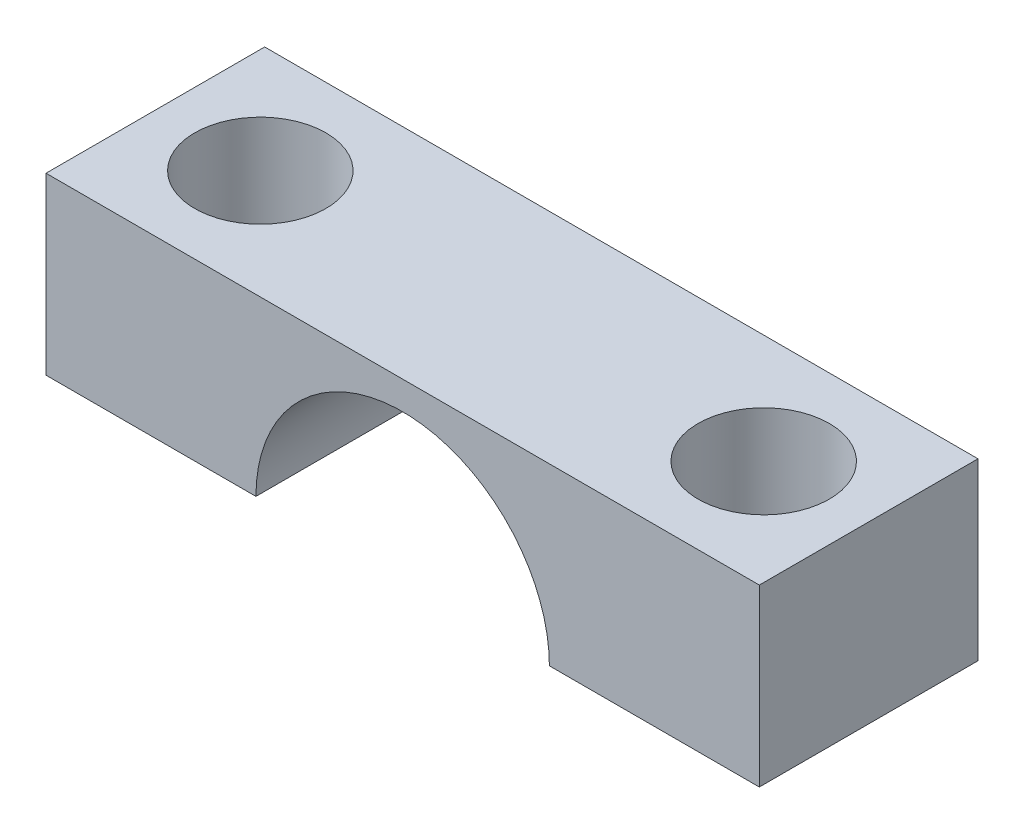
ISO-10303-21;
HEADER;
FILE_DESCRIPTION(('STEP AP214'),'2;1');
FILE_NAME('part.step','',(''),(''),'','','');
FILE_SCHEMA(('AUTOMOTIVE_DESIGN { 1 0 10303 214 1 1 1 1 }'));
ENDSEC;
DATA;
#1=APPLICATION_CONTEXT('core data for automotive mechanical design processes');
#2=APPLICATION_PROTOCOL_DEFINITION('international standard','automotive_design',2000,#1);
#3=PRODUCT_CONTEXT('',#1,'mechanical');
#4=PRODUCT('Part','Part','',(#3));
#5=PRODUCT_RELATED_PRODUCT_CATEGORY('part','',(#4));
#6=PRODUCT_DEFINITION_FORMATION('','',#4);
#7=PRODUCT_DEFINITION_CONTEXT('part definition',#1,'design');
#8=PRODUCT_DEFINITION('design','',#6,#7);
#9=PRODUCT_DEFINITION_SHAPE('','',#8);
#10=(LENGTH_UNIT() NAMED_UNIT(*) SI_UNIT(.MILLI.,.METRE.));
#11=(NAMED_UNIT(*) PLANE_ANGLE_UNIT() SI_UNIT($,.RADIAN.));
#12=(NAMED_UNIT(*) SI_UNIT($,.STERADIAN.) SOLID_ANGLE_UNIT());
#13=UNCERTAINTY_MEASURE_WITH_UNIT(LENGTH_MEASURE(1.E-05),#10,'distance_accuracy_value','');
#14=(GEOMETRIC_REPRESENTATION_CONTEXT(3) GLOBAL_UNCERTAINTY_ASSIGNED_CONTEXT((#13)) GLOBAL_UNIT_ASSIGNED_CONTEXT((#10,
#11,#12)) REPRESENTATION_CONTEXT('',''));
#15=CARTESIAN_POINT('',(0.,0.,0.));
#16=DIRECTION('',(0.,0.,1.));
#17=DIRECTION('',(1.,0.,0.));
#18=AXIS2_PLACEMENT_3D('',#15,#16,#17);
#19=CARTESIAN_POINT('',(-8.155,-2.,-5.));
#20=DIRECTION('',(0.,-1.,0.));
#21=DIRECTION('',(0.,0.,-1.));
#22=AXIS2_PLACEMENT_3D('',#19,#20,#21);
#23=PLANE('',#22);
#24=CARTESIAN_POINT('',(5.755,-2.,-2.5));
#25=DIRECTION('',(0.,-1.,0.));
#26=DIRECTION('',(0.,0.,-1.));
#27=AXIS2_PLACEMENT_3D('',#24,#25,#26);
#28=CIRCLE('',#27,1.5);
#29=CARTESIAN_POINT('',(5.755,-2.,-4.));
#30=VERTEX_POINT('',#29);
#31=EDGE_CURVE('E136',#30,#30,#28,.F.);
#32=ORIENTED_EDGE('',*,*,#31,.T.);
#33=EDGE_LOOP('',(#32));
#34=FACE_BOUND('',#33,.T.);
#35=DIRECTION('',(0.,0.,1.));
#36=VECTOR('',#35,1.);
#37=CARTESIAN_POINT('',(3.355,-2.,-5.));
#38=LINE('',#37,#36);
#39=CARTESIAN_POINT('',(3.355,-2.,-5.));
#40=VERTEX_POINT('',#39);
#41=CARTESIAN_POINT('',(3.355,-2.,0.));
#42=VERTEX_POINT('',#41);
#43=EDGE_CURVE('E53',#40,#42,#38,.T.);
#44=ORIENTED_EDGE('',*,*,#43,.F.);
#45=DIRECTION('',(1.,0.,0.));
#46=VECTOR('',#45,1.);
#47=CARTESIAN_POINT('',(-8.155,-2.,-5.));
#48=LINE('',#47,#46);
#49=CARTESIAN_POINT('',(8.155,-2.,-5.));
#50=VERTEX_POINT('',#49);
#51=EDGE_CURVE('E85',#40,#50,#48,.T.);
#52=ORIENTED_EDGE('',*,*,#51,.T.);
#53=DIRECTION('',(0.,0.,1.));
#54=VECTOR('',#53,1.);
#55=CARTESIAN_POINT('',(8.155,-2.,-5.));
#56=LINE('',#55,#54);
#57=CARTESIAN_POINT('',(8.155,-2.,0.));
#58=VERTEX_POINT('',#57);
#59=EDGE_CURVE('E119',#50,#58,#56,.T.);
#60=ORIENTED_EDGE('',*,*,#59,.T.);
#61=DIRECTION('',(1.,0.,0.));
#62=VECTOR('',#61,1.);
#63=CARTESIAN_POINT('',(-8.155,-2.,0.));
#64=LINE('',#63,#62);
#65=EDGE_CURVE('E123',#42,#58,#64,.T.);
#66=ORIENTED_EDGE('',*,*,#65,.F.);
#67=EDGE_LOOP('',(#44,#52,#60,#66));
#68=FACE_BOUND('',#67,.T.);
#69=ADVANCED_FACE('F36',(#34,#68),#23,.T.);
#70=CARTESIAN_POINT('',(-5.755,-2.,-2.5));
#71=DIRECTION('',(0.,-1.,0.));
#72=DIRECTION('',(0.,0.,-1.));
#73=AXIS2_PLACEMENT_3D('',#70,#71,#72);
#74=CIRCLE('',#73,1.5);
#75=CARTESIAN_POINT('',(-5.755,-2.,-4.));
#76=VERTEX_POINT('',#75);
#77=EDGE_CURVE('E144',#76,#76,#74,.F.);
#78=ORIENTED_EDGE('',*,*,#77,.T.);
#79=EDGE_LOOP('',(#78));
#80=FACE_BOUND('',#79,.T.);
#81=DIRECTION('',(0.,0.,1.));
#82=VECTOR('',#81,1.);
#83=CARTESIAN_POINT('',(-3.355,-2.,-5.));
#84=LINE('',#83,#82);
#85=CARTESIAN_POINT('',(-3.355,-2.,-5.));
#86=VERTEX_POINT('',#85);
#87=CARTESIAN_POINT('',(-3.355,-2.,0.));
#88=VERTEX_POINT('',#87);
#89=EDGE_CURVE('E95',#86,#88,#84,.T.);
#90=ORIENTED_EDGE('',*,*,#89,.T.);
#91=CARTESIAN_POINT('',(-8.155,-2.,0.));
#92=VERTEX_POINT('',#91);
#93=EDGE_CURVE('E120',#92,#88,#64,.T.);
#94=ORIENTED_EDGE('',*,*,#93,.F.);
#95=DIRECTION('',(0.,0.,1.));
#96=VECTOR('',#95,1.);
#97=CARTESIAN_POINT('',(-8.155,-2.,-5.));
#98=LINE('',#97,#96);
#99=CARTESIAN_POINT('',(-8.155,-2.,-5.));
#100=VERTEX_POINT('',#99);
#101=EDGE_CURVE('E11',#100,#92,#98,.T.);
#102=ORIENTED_EDGE('',*,*,#101,.F.);
#103=EDGE_CURVE('E105',#100,#86,#48,.T.);
#104=ORIENTED_EDGE('',*,*,#103,.T.);
#105=EDGE_LOOP('',(#90,#94,#102,#104));
#106=FACE_BOUND('',#105,.T.);
#107=ADVANCED_FACE('F38',(#80,#106),#23,.T.);
#108=CARTESIAN_POINT('',(-8.155,-2.,-5.));
#109=DIRECTION('',(1.,0.,0.));
#110=DIRECTION('',(0.,0.,-1.));
#111=AXIS2_PLACEMENT_3D('',#108,#109,#110);
#112=PLANE('',#111);
#113=DIRECTION('',(0.,1.,0.));
#114=VECTOR('',#113,1.);
#115=CARTESIAN_POINT('',(-8.155,-2.,0.));
#116=LINE('',#115,#114);
#117=CARTESIAN_POINT('',(-8.155,2.,0.));
#118=VERTEX_POINT('',#117);
#119=EDGE_CURVE('E113',#92,#118,#116,.T.);
#120=ORIENTED_EDGE('',*,*,#119,.T.);
#121=DIRECTION('',(0.,0.,1.));
#122=VECTOR('',#121,1.);
#123=CARTESIAN_POINT('',(-8.155,2.,-5.));
#124=LINE('',#123,#122);
#125=CARTESIAN_POINT('',(-8.155,2.,-5.));
#126=VERTEX_POINT('',#125);
#127=EDGE_CURVE('E45',#126,#118,#124,.T.);
#128=ORIENTED_EDGE('',*,*,#127,.F.);
#129=DIRECTION('',(0.,1.,0.));
#130=VECTOR('',#129,1.);
#131=CARTESIAN_POINT('',(-8.155,-2.,-5.));
#132=LINE('',#131,#130);
#133=EDGE_CURVE('E117',#100,#126,#132,.T.);
#134=ORIENTED_EDGE('',*,*,#133,.F.);
#135=ORIENTED_EDGE('',*,*,#101,.T.);
#136=EDGE_LOOP('',(#120,#128,#134,#135));
#137=FACE_BOUND('',#136,.T.);
#138=ADVANCED_FACE('F160',(#137),#112,.F.);
#139=CARTESIAN_POINT('',(-8.155,2.,-5.));
#140=DIRECTION('',(0.,-1.,0.));
#141=DIRECTION('',(0.,0.,-1.));
#142=AXIS2_PLACEMENT_3D('',#139,#140,#141);
#143=PLANE('',#142);
#144=CARTESIAN_POINT('',(-5.755,2.,-2.5));
#145=DIRECTION('',(0.,-1.,0.));
#146=DIRECTION('',(0.,0.,-1.));
#147=AXIS2_PLACEMENT_3D('',#144,#145,#146);
#148=CIRCLE('',#147,1.5);
#149=CARTESIAN_POINT('',(-5.755,2.,-4.));
#150=VERTEX_POINT('',#149);
#151=EDGE_CURVE('E40',#150,#150,#148,.F.);
#152=ORIENTED_EDGE('',*,*,#151,.F.);
#153=EDGE_LOOP('',(#152));
#154=FACE_BOUND('',#153,.T.);
#155=CARTESIAN_POINT('',(5.755,2.,-2.5));
#156=DIRECTION('',(0.,-1.,0.));
#157=DIRECTION('',(0.,0.,-1.));
#158=AXIS2_PLACEMENT_3D('',#155,#156,#157);
#159=CIRCLE('',#158,1.5);
#160=CARTESIAN_POINT('',(5.755,2.,-4.));
#161=VERTEX_POINT('',#160);
#162=EDGE_CURVE('E134',#161,#161,#159,.F.);
#163=ORIENTED_EDGE('',*,*,#162,.F.);
#164=EDGE_LOOP('',(#163));
#165=FACE_BOUND('',#164,.T.);
#166=DIRECTION('',(1.,0.,0.));
#167=VECTOR('',#166,1.);
#168=CARTESIAN_POINT('',(-8.155,2.,0.));
#169=LINE('',#168,#167);
#170=CARTESIAN_POINT('',(8.155,2.,0.));
#171=VERTEX_POINT('',#170);
#172=EDGE_CURVE('E126',#118,#171,#169,.T.);
#173=ORIENTED_EDGE('',*,*,#172,.T.);
#174=DIRECTION('',(0.,0.,1.));
#175=VECTOR('',#174,1.);
#176=CARTESIAN_POINT('',(8.155,2.,-5.));
#177=LINE('',#176,#175);
#178=CARTESIAN_POINT('',(8.155,2.,-5.));
#179=VERTEX_POINT('',#178);
#180=EDGE_CURVE('E132',#179,#171,#177,.T.);
#181=ORIENTED_EDGE('',*,*,#180,.F.);
#182=DIRECTION('',(1.,0.,0.));
#183=VECTOR('',#182,1.);
#184=CARTESIAN_POINT('',(-8.155,2.,-5.));
#185=LINE('',#184,#183);
#186=EDGE_CURVE('E111',#126,#179,#185,.T.);
#187=ORIENTED_EDGE('',*,*,#186,.F.);
#188=ORIENTED_EDGE('',*,*,#127,.T.);
#189=EDGE_LOOP('',(#173,#181,#187,#188));
#190=FACE_BOUND('',#189,.T.);
#191=ADVANCED_FACE('F158',(#154,#165,#190),#143,.F.);
#192=CARTESIAN_POINT('',(8.155,-2.,-5.));
#193=DIRECTION('',(1.,0.,0.));
#194=DIRECTION('',(0.,0.,-1.));
#195=AXIS2_PLACEMENT_3D('',#192,#193,#194);
#196=PLANE('',#195);
#197=DIRECTION('',(0.,1.,0.));
#198=VECTOR('',#197,1.);
#199=CARTESIAN_POINT('',(8.155,-2.,0.));
#200=LINE('',#199,#198);
#201=EDGE_CURVE('E122',#58,#171,#200,.T.);
#202=ORIENTED_EDGE('',*,*,#201,.F.);
#203=ORIENTED_EDGE('',*,*,#59,.F.);
#204=DIRECTION('',(0.,1.,0.));
#205=VECTOR('',#204,1.);
#206=CARTESIAN_POINT('',(8.155,-2.,-5.));
#207=LINE('',#206,#205);
#208=EDGE_CURVE('E108',#50,#179,#207,.T.);
#209=ORIENTED_EDGE('',*,*,#208,.T.);
#210=ORIENTED_EDGE('',*,*,#180,.T.);
#211=EDGE_LOOP('',(#202,#203,#209,#210));
#212=FACE_BOUND('',#211,.T.);
#213=ADVANCED_FACE('F154',(#212),#196,.T.);
#214=CARTESIAN_POINT('',(0.,0.,-5.));
#215=DIRECTION('',(0.,0.,1.));
#216=DIRECTION('',(1.,0.,0.));
#217=AXIS2_PLACEMENT_3D('',#214,#215,#216);
#218=PLANE('',#217);
#219=ORIENTED_EDGE('',*,*,#51,.F.);
#220=CARTESIAN_POINT('',(0.,-2.,-5.));
#221=DIRECTION('',(0.,0.,1.));
#222=DIRECTION('',(1.,0.,0.));
#223=AXIS2_PLACEMENT_3D('',#220,#221,#222);
#224=CIRCLE('',#223,3.355);
#225=EDGE_CURVE('E98',#40,#86,#224,.T.);
#226=ORIENTED_EDGE('',*,*,#225,.T.);
#227=ORIENTED_EDGE('',*,*,#103,.F.);
#228=ORIENTED_EDGE('',*,*,#133,.T.);
#229=ORIENTED_EDGE('',*,*,#186,.T.);
#230=ORIENTED_EDGE('',*,*,#208,.F.);
#231=EDGE_LOOP('',(#219,#226,#227,#228,#229,#230));
#232=FACE_BOUND('',#231,.T.);
#233=ADVANCED_FACE('F104',(#232),#218,.F.);
#234=CARTESIAN_POINT('',(0.,0.,0.));
#235=DIRECTION('',(0.,0.,1.));
#236=DIRECTION('',(1.,0.,0.));
#237=AXIS2_PLACEMENT_3D('',#234,#235,#236);
#238=PLANE('',#237);
#239=CARTESIAN_POINT('',(0.,-2.,0.));
#240=DIRECTION('',(0.,0.,1.));
#241=DIRECTION('',(1.,0.,0.));
#242=AXIS2_PLACEMENT_3D('',#239,#240,#241);
#243=CIRCLE('',#242,3.355);
#244=EDGE_CURVE('E99',#42,#88,#243,.T.);
#245=ORIENTED_EDGE('',*,*,#244,.F.);
#246=ORIENTED_EDGE('',*,*,#65,.T.);
#247=ORIENTED_EDGE('',*,*,#201,.T.);
#248=ORIENTED_EDGE('',*,*,#172,.F.);
#249=ORIENTED_EDGE('',*,*,#119,.F.);
#250=ORIENTED_EDGE('',*,*,#93,.T.);
#251=EDGE_LOOP('',(#245,#246,#247,#248,#249,#250));
#252=FACE_BOUND('',#251,.T.);
#253=ADVANCED_FACE('F150',(#252),#238,.T.);
#254=CARTESIAN_POINT('',(0.,-2.,-5.));
#255=DIRECTION('',(0.,0.,1.));
#256=DIRECTION('',(1.,0.,0.));
#257=AXIS2_PLACEMENT_3D('',#254,#255,#256);
#258=CYLINDRICAL_SURFACE('',#257,3.355);
#259=ORIENTED_EDGE('',*,*,#244,.T.);
#260=ORIENTED_EDGE('',*,*,#89,.F.);
#261=ORIENTED_EDGE('',*,*,#225,.F.);
#262=ORIENTED_EDGE('',*,*,#43,.T.);
#263=EDGE_LOOP('',(#259,#260,#261,#262));
#264=FACE_BOUND('',#263,.T.);
#265=ADVANCED_FACE('F97',(#264),#258,.F.);
#266=CARTESIAN_POINT('',(5.755,2.5,-2.5));
#267=DIRECTION('',(0.,-1.,0.));
#268=DIRECTION('',(0.,0.,-1.));
#269=AXIS2_PLACEMENT_3D('',#266,#267,#268);
#270=CYLINDRICAL_SURFACE('',#269,1.5);
#271=ORIENTED_EDGE('',*,*,#31,.F.);
#272=EDGE_LOOP('',(#271));
#273=FACE_BOUND('',#272,.T.);
#274=ORIENTED_EDGE('',*,*,#162,.T.);
#275=EDGE_LOOP('',(#274));
#276=FACE_BOUND('',#275,.T.);
#277=ADVANCED_FACE('F193',(#273,#276),#270,.F.);
#278=CARTESIAN_POINT('',(-5.755,2.5,-2.5));
#279=DIRECTION('',(0.,-1.,0.));
#280=DIRECTION('',(0.,0.,-1.));
#281=AXIS2_PLACEMENT_3D('',#278,#279,#280);
#282=CYLINDRICAL_SURFACE('',#281,1.5);
#283=ORIENTED_EDGE('',*,*,#77,.F.);
#284=EDGE_LOOP('',(#283));
#285=FACE_BOUND('',#284,.T.);
#286=ORIENTED_EDGE('',*,*,#151,.T.);
#287=EDGE_LOOP('',(#286));
#288=FACE_BOUND('',#287,.T.);
#289=ADVANCED_FACE('F198',(#285,#288),#282,.F.);
#290=CLOSED_SHELL('',(#69,#107,#138,#191,#213,#233,#253,#265,#277,#289));
#291=MANIFOLD_SOLID_BREP('B2',#290);
#292=ADVANCED_BREP_SHAPE_REPRESENTATION('',(#18,#291),#14);
#293=SHAPE_DEFINITION_REPRESENTATION(#9,#292);
ENDSEC;
END-ISO-10303-21;
